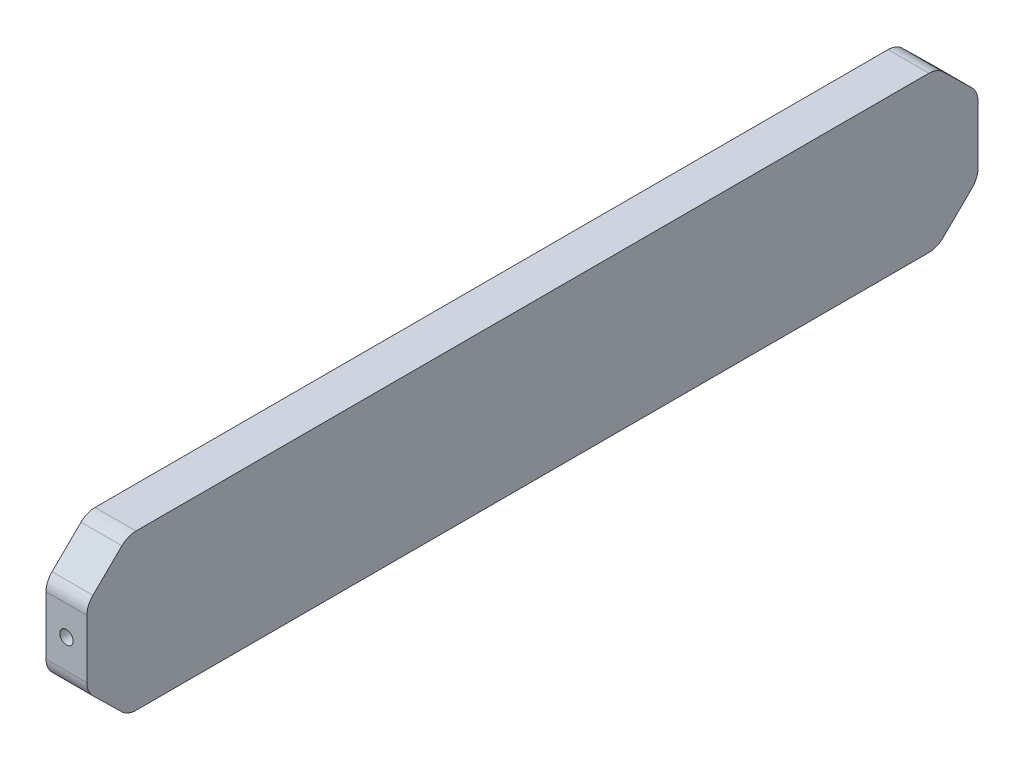
ISO-10303-21;
HEADER;
FILE_DESCRIPTION(('STEP AP214'),'2;1');
FILE_NAME('part.step','',(''),(''),'','','');
FILE_SCHEMA(('AUTOMOTIVE_DESIGN { 1 0 10303 214 1 1 1 1 }'));
ENDSEC;
DATA;
#1=APPLICATION_CONTEXT('core data for automotive mechanical design processes');
#2=APPLICATION_PROTOCOL_DEFINITION('international standard','automotive_design',2000,#1);
#3=PRODUCT_CONTEXT('',#1,'mechanical');
#4=PRODUCT('Part','Part','',(#3));
#5=PRODUCT_RELATED_PRODUCT_CATEGORY('part','',(#4));
#6=PRODUCT_DEFINITION_FORMATION('','',#4);
#7=PRODUCT_DEFINITION_CONTEXT('part definition',#1,'design');
#8=PRODUCT_DEFINITION('design','',#6,#7);
#9=PRODUCT_DEFINITION_SHAPE('','',#8);
#10=(LENGTH_UNIT() NAMED_UNIT(*) SI_UNIT(.MILLI.,.METRE.));
#11=(NAMED_UNIT(*) PLANE_ANGLE_UNIT() SI_UNIT($,.RADIAN.));
#12=(NAMED_UNIT(*) SI_UNIT($,.STERADIAN.) SOLID_ANGLE_UNIT());
#13=UNCERTAINTY_MEASURE_WITH_UNIT(LENGTH_MEASURE(1.E-05),#10,'distance_accuracy_value','');
#14=(GEOMETRIC_REPRESENTATION_CONTEXT(3) GLOBAL_UNCERTAINTY_ASSIGNED_CONTEXT((#13)) GLOBAL_UNIT_ASSIGNED_CONTEXT((#10,
#11,#12)) REPRESENTATION_CONTEXT('',''));
#15=CARTESIAN_POINT('',(0.,0.,0.));
#16=DIRECTION('',(0.,0.,1.));
#17=DIRECTION('',(1.,0.,0.));
#18=AXIS2_PLACEMENT_3D('',#15,#16,#17);
#19=CARTESIAN_POINT('',(0.,38.,0.));
#20=DIRECTION('',(1.,0.,0.));
#21=DIRECTION('',(0.,0.,-1.));
#22=AXIS2_PLACEMENT_3D('',#19,#20,#21);
#23=PLANE('',#22);
#24=DIRECTION('',(0.,0.,1.));
#25=VECTOR('',#24,1.);
#26=CARTESIAN_POINT('',(0.,0.,0.));
#27=LINE('',#26,#25);
#28=CARTESIAN_POINT('',(0.,0.,-205.991418410937));
#29=VERTEX_POINT('',#28);
#30=CARTESIAN_POINT('',(0.,0.,-12.0085815890628));
#31=VERTEX_POINT('',#30);
#32=EDGE_CURVE('E195',#29,#31,#27,.T.);
#33=ORIENTED_EDGE('',*,*,#32,.T.);
#34=CARTESIAN_POINT('',(0.,4.92,-12.0085815890628));
#35=DIRECTION('',(1.,0.,0.));
#36=DIRECTION('',(0.,0.,-1.));
#37=AXIS2_PLACEMENT_3D('',#34,#35,#36);
#38=CIRCLE('',#37,4.92);
#39=CARTESIAN_POINT('',(0.,1.40571428569097,-8.56529886494569));
#40=VERTEX_POINT('',#39);
#41=EDGE_CURVE('E238',#31,#40,#38,.F.);
#42=ORIENTED_EDGE('',*,*,#41,.T.);
#43=DIRECTION('',(0.,0.699854212218928,0.714285714290453));
#44=VECTOR('',#43,1.);
#45=CARTESIAN_POINT('',(0.,0.,-10.));
#46=LINE('',#45,#44);
#47=CARTESIAN_POINT('',(0.,8.35107744291331,-1.47671727588287));
#48=VERTEX_POINT('',#47);
#49=EDGE_CURVE('E184',#40,#48,#46,.T.);
#50=ORIENTED_EDGE('',*,*,#49,.T.);
#51=CARTESIAN_POINT('',(0.,11.8653631572223,-4.92));
#52=DIRECTION('',(1.,0.,0.));
#53=DIRECTION('',(0.,0.,-1.));
#54=AXIS2_PLACEMENT_3D('',#51,#52,#53);
#55=CIRCLE('',#54,4.92);
#56=CARTESIAN_POINT('',(0.,11.8653631572223,0.));
#57=VERTEX_POINT('',#56);
#58=EDGE_CURVE('E236',#48,#57,#55,.F.);
#59=ORIENTED_EDGE('',*,*,#58,.T.);
#60=DIRECTION('',(0.,-1.,0.));
#61=VECTOR('',#60,1.);
#62=CARTESIAN_POINT('',(0.,38.,0.));
#63=LINE('',#62,#61);
#64=CARTESIAN_POINT('',(0.,26.1346368427777,0.));
#65=VERTEX_POINT('',#64);
#66=EDGE_CURVE('E216',#65,#57,#63,.T.);
#67=ORIENTED_EDGE('',*,*,#66,.F.);
#68=CARTESIAN_POINT('',(0.,26.1346368427777,-4.92));
#69=DIRECTION('',(1.,0.,0.));
#70=DIRECTION('',(0.,0.,-1.));
#71=AXIS2_PLACEMENT_3D('',#68,#69,#70);
#72=CIRCLE('',#71,4.92);
#73=CARTESIAN_POINT('',(0.,29.6489225570867,-1.47671727588287));
#74=VERTEX_POINT('',#73);
#75=EDGE_CURVE('E234',#65,#74,#72,.F.);
#76=ORIENTED_EDGE('',*,*,#75,.T.);
#77=DIRECTION('',(0.,0.699854212218928,-0.714285714290453));
#78=VECTOR('',#77,1.);
#79=CARTESIAN_POINT('',(0.,38.,-10.));
#80=LINE('',#79,#78);
#81=CARTESIAN_POINT('',(0.,36.594285714309,-8.56529886494565));
#82=VERTEX_POINT('',#81);
#83=EDGE_CURVE('E173',#74,#82,#80,.T.);
#84=ORIENTED_EDGE('',*,*,#83,.T.);
#85=CARTESIAN_POINT('',(0.,33.08,-12.0085815890628));
#86=DIRECTION('',(1.,0.,0.));
#87=DIRECTION('',(0.,0.,-1.));
#88=AXIS2_PLACEMENT_3D('',#85,#86,#87);
#89=CIRCLE('',#88,4.92);
#90=CARTESIAN_POINT('',(0.,38.,-12.0085815890628));
#91=VERTEX_POINT('',#90);
#92=EDGE_CURVE('E232',#82,#91,#89,.F.);
#93=ORIENTED_EDGE('',*,*,#92,.T.);
#94=DIRECTION('',(0.,0.,1.));
#95=VECTOR('',#94,1.);
#96=CARTESIAN_POINT('',(0.,38.,0.));
#97=LINE('',#96,#95);
#98=CARTESIAN_POINT('',(0.,38.,-205.991418410937));
#99=VERTEX_POINT('',#98);
#100=EDGE_CURVE('E198',#99,#91,#97,.T.);
#101=ORIENTED_EDGE('',*,*,#100,.F.);
#102=CARTESIAN_POINT('',(0.,33.08,-205.991418410937));
#103=DIRECTION('',(1.,0.,0.));
#104=DIRECTION('',(0.,0.,-1.));
#105=AXIS2_PLACEMENT_3D('',#102,#103,#104);
#106=CIRCLE('',#105,4.92);
#107=CARTESIAN_POINT('',(0.,36.594285714309,-209.434701135054));
#108=VERTEX_POINT('',#107);
#109=EDGE_CURVE('E224',#99,#108,#106,.F.);
#110=ORIENTED_EDGE('',*,*,#109,.T.);
#111=DIRECTION('',(0.,-0.699854212218928,-0.714285714290453));
#112=VECTOR('',#111,1.);
#113=CARTESIAN_POINT('',(0.,38.,-208.));
#114=LINE('',#113,#112);
#115=CARTESIAN_POINT('',(0.,29.6489225570867,-216.523282724117));
#116=VERTEX_POINT('',#115);
#117=EDGE_CURVE('E177',#108,#116,#114,.T.);
#118=ORIENTED_EDGE('',*,*,#117,.T.);
#119=CARTESIAN_POINT('',(0.,26.1346368427777,-213.08));
#120=DIRECTION('',(1.,0.,0.));
#121=DIRECTION('',(0.,0.,-1.));
#122=AXIS2_PLACEMENT_3D('',#119,#120,#121);
#123=CIRCLE('',#122,4.92);
#124=CARTESIAN_POINT('',(0.,26.1346368427777,-218.));
#125=VERTEX_POINT('',#124);
#126=EDGE_CURVE('E226',#116,#125,#123,.F.);
#127=ORIENTED_EDGE('',*,*,#126,.T.);
#128=DIRECTION('',(0.,-1.,0.));
#129=VECTOR('',#128,1.);
#130=CARTESIAN_POINT('',(0.,38.,-218.));
#131=LINE('',#130,#129);
#132=CARTESIAN_POINT('',(0.,11.8653631572223,-218.));
#133=VERTEX_POINT('',#132);
#134=EDGE_CURVE('E203',#125,#133,#131,.T.);
#135=ORIENTED_EDGE('',*,*,#134,.T.);
#136=CARTESIAN_POINT('',(0.,11.8653631572223,-213.08));
#137=DIRECTION('',(1.,0.,0.));
#138=DIRECTION('',(0.,0.,-1.));
#139=AXIS2_PLACEMENT_3D('',#136,#137,#138);
#140=CIRCLE('',#139,4.92);
#141=CARTESIAN_POINT('',(0.,8.35107744291325,-216.523282724117));
#142=VERTEX_POINT('',#141);
#143=EDGE_CURVE('E228',#133,#142,#140,.F.);
#144=ORIENTED_EDGE('',*,*,#143,.T.);
#145=DIRECTION('',(0.,-0.699854212218928,0.714285714290453));
#146=VECTOR('',#145,1.);
#147=CARTESIAN_POINT('',(0.,0.,-208.));
#148=LINE('',#147,#146);
#149=CARTESIAN_POINT('',(0.,1.40571428569097,-209.434701135054));
#150=VERTEX_POINT('',#149);
#151=EDGE_CURVE('E178',#142,#150,#148,.T.);
#152=ORIENTED_EDGE('',*,*,#151,.T.);
#153=CARTESIAN_POINT('',(0.,4.92,-205.991418410937));
#154=DIRECTION('',(1.,0.,0.));
#155=DIRECTION('',(0.,0.,-1.));
#156=AXIS2_PLACEMENT_3D('',#153,#154,#155);
#157=CIRCLE('',#156,4.92);
#158=EDGE_CURVE('E230',#150,#29,#157,.F.);
#159=ORIENTED_EDGE('',*,*,#158,.T.);
#160=EDGE_LOOP('',(#33,#42,#50,#59,#67,#76,#84,#93,#101,#110,#118,#127,#135,#144,#152,#159));
#161=FACE_BOUND('',#160,.T.);
#162=ADVANCED_FACE('F33',(#161),#23,.F.);
#163=CARTESIAN_POINT('',(0.,38.,0.));
#164=DIRECTION('',(0.,0.,-1.));
#165=DIRECTION('',(-1.,0.,0.));
#166=AXIS2_PLACEMENT_3D('',#163,#164,#165);
#167=PLANE('',#166);
#168=CARTESIAN_POINT('',(5.,19.,0.));
#169=DIRECTION('',(0.,0.,1.));
#170=DIRECTION('',(1.,0.,0.));
#171=AXIS2_PLACEMENT_3D('',#168,#169,#170);
#172=CIRCLE('',#171,1.63195);
#173=CARTESIAN_POINT('',(6.63195,19.,0.));
#174=VERTEX_POINT('',#173);
#175=EDGE_CURVE('E162',#174,#174,#172,.T.);
#176=ORIENTED_EDGE('',*,*,#175,.F.);
#177=EDGE_LOOP('',(#176));
#178=FACE_BOUND('',#177,.T.);
#179=ORIENTED_EDGE('',*,*,#66,.T.);
#180=DIRECTION('',(-1.,0.,0.));
#181=VECTOR('',#180,1.);
#182=CARTESIAN_POINT('',(10.,11.8653631572223,0.));
#183=LINE('',#182,#181);
#184=CARTESIAN_POINT('',(10.,11.8653631572223,0.));
#185=VERTEX_POINT('',#184);
#186=EDGE_CURVE('E263',#57,#185,#183,.F.);
#187=ORIENTED_EDGE('',*,*,#186,.T.);
#188=DIRECTION('',(0.,-1.,0.));
#189=VECTOR('',#188,1.);
#190=CARTESIAN_POINT('',(10.,38.,0.));
#191=LINE('',#190,#189);
#192=CARTESIAN_POINT('',(10.,26.1346368427777,0.));
#193=VERTEX_POINT('',#192);
#194=EDGE_CURVE('E213',#193,#185,#191,.T.);
#195=ORIENTED_EDGE('',*,*,#194,.F.);
#196=DIRECTION('',(-1.,0.,0.));
#197=VECTOR('',#196,1.);
#198=CARTESIAN_POINT('',(0.,26.1346368427777,0.));
#199=LINE('',#198,#197);
#200=EDGE_CURVE('E260',#193,#65,#199,.T.);
#201=ORIENTED_EDGE('',*,*,#200,.T.);
#202=EDGE_LOOP('',(#179,#187,#195,#201));
#203=FACE_BOUND('',#202,.T.);
#204=ADVANCED_FACE('F313',(#178,#203),#167,.F.);
#205=CARTESIAN_POINT('',(10.,38.,0.));
#206=DIRECTION('',(-1.,0.,0.));
#207=DIRECTION('',(0.,0.,1.));
#208=AXIS2_PLACEMENT_3D('',#205,#206,#207);
#209=PLANE('',#208);
#210=DIRECTION('',(0.,0.699854212218928,0.714285714290453));
#211=VECTOR('',#210,1.);
#212=CARTESIAN_POINT('',(10.,0.,-10.));
#213=LINE('',#212,#211);
#214=CARTESIAN_POINT('',(10.,1.40571428569097,-8.56529886494569));
#215=VERTEX_POINT('',#214);
#216=CARTESIAN_POINT('',(10.,8.35107744291331,-1.47671727588287));
#217=VERTEX_POINT('',#216);
#218=EDGE_CURVE('E181',#215,#217,#213,.T.);
#219=ORIENTED_EDGE('',*,*,#218,.F.);
#220=CARTESIAN_POINT('',(10.,4.92,-12.0085815890628));
#221=DIRECTION('',(-1.,0.,0.));
#222=DIRECTION('',(0.,0.,1.));
#223=AXIS2_PLACEMENT_3D('',#220,#221,#222);
#224=CIRCLE('',#223,4.92);
#225=CARTESIAN_POINT('',(10.,0.,-12.0085815890628));
#226=VERTEX_POINT('',#225);
#227=EDGE_CURVE('E258',#215,#226,#224,.F.);
#228=ORIENTED_EDGE('',*,*,#227,.T.);
#229=DIRECTION('',(0.,0.,-1.));
#230=VECTOR('',#229,1.);
#231=CARTESIAN_POINT('',(10.,0.,0.));
#232=LINE('',#231,#230);
#233=CARTESIAN_POINT('',(10.,0.,-205.991418410937));
#234=VERTEX_POINT('',#233);
#235=EDGE_CURVE('E201',#226,#234,#232,.T.);
#236=ORIENTED_EDGE('',*,*,#235,.T.);
#237=CARTESIAN_POINT('',(10.,4.92,-205.991418410937));
#238=DIRECTION('',(-1.,0.,0.));
#239=DIRECTION('',(0.,0.,1.));
#240=AXIS2_PLACEMENT_3D('',#237,#238,#239);
#241=CIRCLE('',#240,4.92);
#242=CARTESIAN_POINT('',(10.,1.40571428569097,-209.434701135054));
#243=VERTEX_POINT('',#242);
#244=EDGE_CURVE('E250',#234,#243,#241,.F.);
#245=ORIENTED_EDGE('',*,*,#244,.T.);
#246=DIRECTION('',(0.,-0.699854212218928,0.714285714290453));
#247=VECTOR('',#246,1.);
#248=CARTESIAN_POINT('',(10.,0.,-208.));
#249=LINE('',#248,#247);
#250=CARTESIAN_POINT('',(10.,8.35107744291325,-216.523282724117));
#251=VERTEX_POINT('',#250);
#252=EDGE_CURVE('E174',#251,#243,#249,.T.);
#253=ORIENTED_EDGE('',*,*,#252,.F.);
#254=CARTESIAN_POINT('',(10.,11.8653631572223,-213.08));
#255=DIRECTION('',(-1.,0.,0.));
#256=DIRECTION('',(0.,0.,1.));
#257=AXIS2_PLACEMENT_3D('',#254,#255,#256);
#258=CIRCLE('',#257,4.92);
#259=CARTESIAN_POINT('',(10.,11.8653631572223,-218.));
#260=VERTEX_POINT('',#259);
#261=EDGE_CURVE('E248',#251,#260,#258,.F.);
#262=ORIENTED_EDGE('',*,*,#261,.T.);
#263=DIRECTION('',(0.,-1.,0.));
#264=VECTOR('',#263,1.);
#265=CARTESIAN_POINT('',(10.,38.,-218.));
#266=LINE('',#265,#264);
#267=CARTESIAN_POINT('',(10.,26.1346368427777,-218.));
#268=VERTEX_POINT('',#267);
#269=EDGE_CURVE('E210',#268,#260,#266,.T.);
#270=ORIENTED_EDGE('',*,*,#269,.F.);
#271=CARTESIAN_POINT('',(10.,26.1346368427777,-213.08));
#272=DIRECTION('',(-1.,0.,0.));
#273=DIRECTION('',(0.,0.,1.));
#274=AXIS2_PLACEMENT_3D('',#271,#272,#273);
#275=CIRCLE('',#274,4.92);
#276=CARTESIAN_POINT('',(10.,29.6489225570867,-216.523282724117));
#277=VERTEX_POINT('',#276);
#278=EDGE_CURVE('E246',#268,#277,#275,.F.);
#279=ORIENTED_EDGE('',*,*,#278,.T.);
#280=DIRECTION('',(0.,-0.699854212218928,-0.714285714290453));
#281=VECTOR('',#280,1.);
#282=CARTESIAN_POINT('',(10.,38.,-208.));
#283=LINE('',#282,#281);
#284=CARTESIAN_POINT('',(10.,36.594285714309,-209.434701135054));
#285=VERTEX_POINT('',#284);
#286=EDGE_CURVE('E192',#285,#277,#283,.T.);
#287=ORIENTED_EDGE('',*,*,#286,.F.);
#288=CARTESIAN_POINT('',(10.,33.08,-205.991418410937));
#289=DIRECTION('',(-1.,0.,0.));
#290=DIRECTION('',(0.,0.,1.));
#291=AXIS2_PLACEMENT_3D('',#288,#289,#290);
#292=CIRCLE('',#291,4.92);
#293=CARTESIAN_POINT('',(10.,38.,-205.991418410937));
#294=VERTEX_POINT('',#293);
#295=EDGE_CURVE('E48',#285,#294,#292,.F.);
#296=ORIENTED_EDGE('',*,*,#295,.T.);
#297=DIRECTION('',(0.,0.,-1.));
#298=VECTOR('',#297,1.);
#299=CARTESIAN_POINT('',(10.,38.,0.));
#300=LINE('',#299,#298);
#301=CARTESIAN_POINT('',(10.,38.,-12.0085815890628));
#302=VERTEX_POINT('',#301);
#303=EDGE_CURVE('E200',#302,#294,#300,.T.);
#304=ORIENTED_EDGE('',*,*,#303,.F.);
#305=CARTESIAN_POINT('',(10.,33.08,-12.0085815890628));
#306=DIRECTION('',(-1.,0.,0.));
#307=DIRECTION('',(0.,0.,1.));
#308=AXIS2_PLACEMENT_3D('',#305,#306,#307);
#309=CIRCLE('',#308,4.92);
#310=CARTESIAN_POINT('',(10.,36.594285714309,-8.56529886494565));
#311=VERTEX_POINT('',#310);
#312=EDGE_CURVE('E252',#302,#311,#309,.F.);
#313=ORIENTED_EDGE('',*,*,#312,.T.);
#314=DIRECTION('',(0.,0.699854212218928,-0.714285714290453));
#315=VECTOR('',#314,1.);
#316=CARTESIAN_POINT('',(10.,38.,-10.));
#317=LINE('',#316,#315);
#318=CARTESIAN_POINT('',(10.,29.6489225570867,-1.47671727588287));
#319=VERTEX_POINT('',#318);
#320=EDGE_CURVE('E187',#319,#311,#317,.T.);
#321=ORIENTED_EDGE('',*,*,#320,.F.);
#322=CARTESIAN_POINT('',(10.,26.1346368427777,-4.92));
#323=DIRECTION('',(-1.,0.,0.));
#324=DIRECTION('',(0.,0.,1.));
#325=AXIS2_PLACEMENT_3D('',#322,#323,#324);
#326=CIRCLE('',#325,4.92);
#327=EDGE_CURVE('E254',#319,#193,#326,.F.);
#328=ORIENTED_EDGE('',*,*,#327,.T.);
#329=ORIENTED_EDGE('',*,*,#194,.T.);
#330=CARTESIAN_POINT('',(10.,11.8653631572223,-4.92));
#331=DIRECTION('',(-1.,0.,0.));
#332=DIRECTION('',(0.,0.,1.));
#333=AXIS2_PLACEMENT_3D('',#330,#331,#332);
#334=CIRCLE('',#333,4.92);
#335=EDGE_CURVE('E256',#185,#217,#334,.F.);
#336=ORIENTED_EDGE('',*,*,#335,.T.);
#337=EDGE_LOOP('',(#219,#228,#236,#245,#253,#262,#270,#279,#287,#296,#304,#313,#321,#328,#329,#336));
#338=FACE_BOUND('',#337,.T.);
#339=ADVANCED_FACE('F290',(#338),#209,.F.);
#340=CARTESIAN_POINT('',(0.,38.,-218.));
#341=DIRECTION('',(0.,0.,1.));
#342=DIRECTION('',(1.,0.,0.));
#343=AXIS2_PLACEMENT_3D('',#340,#341,#342);
#344=PLANE('',#343);
#345=CARTESIAN_POINT('',(5.,19.,-218.));
#346=DIRECTION('',(0.,0.,-1.));
#347=DIRECTION('',(-1.,0.,0.));
#348=AXIS2_PLACEMENT_3D('',#345,#346,#347);
#349=CIRCLE('',#348,1.63194999999999);
#350=CARTESIAN_POINT('',(3.36805000000001,19.,-218.));
#351=VERTEX_POINT('',#350);
#352=EDGE_CURVE('E163',#351,#351,#349,.T.);
#353=ORIENTED_EDGE('',*,*,#352,.F.);
#354=EDGE_LOOP('',(#353));
#355=FACE_BOUND('',#354,.T.);
#356=ORIENTED_EDGE('',*,*,#269,.T.);
#357=DIRECTION('',(-1.,0.,0.));
#358=VECTOR('',#357,1.);
#359=CARTESIAN_POINT('',(0.,11.8653631572223,-218.));
#360=LINE('',#359,#358);
#361=EDGE_CURVE('E281',#260,#133,#360,.T.);
#362=ORIENTED_EDGE('',*,*,#361,.T.);
#363=ORIENTED_EDGE('',*,*,#134,.F.);
#364=DIRECTION('',(-1.,0.,0.));
#365=VECTOR('',#364,1.);
#366=CARTESIAN_POINT('',(10.,26.1346368427777,-218.));
#367=LINE('',#366,#365);
#368=EDGE_CURVE('E279',#125,#268,#367,.F.);
#369=ORIENTED_EDGE('',*,*,#368,.T.);
#370=EDGE_LOOP('',(#356,#362,#363,#369));
#371=FACE_BOUND('',#370,.T.);
#372=ADVANCED_FACE('F347',(#355,#371),#344,.F.);
#373=CARTESIAN_POINT('',(0.,38.,0.));
#374=DIRECTION('',(0.,-1.,0.));
#375=DIRECTION('',(0.,0.,-1.));
#376=AXIS2_PLACEMENT_3D('',#373,#374,#375);
#377=PLANE('',#376);
#378=ORIENTED_EDGE('',*,*,#100,.T.);
#379=DIRECTION('',(-1.,0.,0.));
#380=VECTOR('',#379,1.);
#381=CARTESIAN_POINT('',(10.,38.,-12.0085815890628));
#382=LINE('',#381,#380);
#383=EDGE_CURVE('E55',#91,#302,#382,.F.);
#384=ORIENTED_EDGE('',*,*,#383,.T.);
#385=ORIENTED_EDGE('',*,*,#303,.T.);
#386=DIRECTION('',(-1.,0.,0.));
#387=VECTOR('',#386,1.);
#388=CARTESIAN_POINT('',(0.,38.,-205.991418410937));
#389=LINE('',#388,#387);
#390=EDGE_CURVE('E270',#294,#99,#389,.T.);
#391=ORIENTED_EDGE('',*,*,#390,.T.);
#392=EDGE_LOOP('',(#378,#384,#385,#391));
#393=FACE_BOUND('',#392,.T.);
#394=ADVANCED_FACE('F295',(#393),#377,.F.);
#395=CARTESIAN_POINT('',(0.,0.,0.));
#396=DIRECTION('',(0.,-1.,0.));
#397=DIRECTION('',(0.,0.,-1.));
#398=AXIS2_PLACEMENT_3D('',#395,#396,#397);
#399=PLANE('',#398);
#400=ORIENTED_EDGE('',*,*,#235,.F.);
#401=DIRECTION('',(-1.,0.,0.));
#402=VECTOR('',#401,1.);
#403=CARTESIAN_POINT('',(0.,0.,-12.0085815890628));
#404=LINE('',#403,#402);
#405=EDGE_CURVE('E221',#226,#31,#404,.T.);
#406=ORIENTED_EDGE('',*,*,#405,.T.);
#407=ORIENTED_EDGE('',*,*,#32,.F.);
#408=DIRECTION('',(-1.,0.,0.));
#409=VECTOR('',#408,1.);
#410=CARTESIAN_POINT('',(0.,0.,-205.991418410937));
#411=LINE('',#410,#409);
#412=EDGE_CURVE('E219',#29,#234,#411,.F.);
#413=ORIENTED_EDGE('',*,*,#412,.T.);
#414=EDGE_LOOP('',(#400,#406,#407,#413));
#415=FACE_BOUND('',#414,.T.);
#416=ADVANCED_FACE('F330',(#415),#399,.T.);
#417=CARTESIAN_POINT('',(10.,0.,-208.));
#418=DIRECTION('',(0.,-0.714285714290453,-0.699854212218928));
#419=DIRECTION('',(0.,0.699854212218928,-0.714285714290453));
#420=AXIS2_PLACEMENT_3D('',#417,#418,#419);
#421=PLANE('',#420);
#422=ORIENTED_EDGE('',*,*,#252,.T.);
#423=DIRECTION('',(-1.,0.,0.));
#424=VECTOR('',#423,1.);
#425=CARTESIAN_POINT('',(10.,1.40571428569097,-209.434701135054));
#426=LINE('',#425,#424);
#427=EDGE_CURVE('E276',#243,#150,#426,.T.);
#428=ORIENTED_EDGE('',*,*,#427,.T.);
#429=ORIENTED_EDGE('',*,*,#151,.F.);
#430=DIRECTION('',(-1.,0.,0.));
#431=VECTOR('',#430,1.);
#432=CARTESIAN_POINT('',(10.,8.35107744291325,-216.523282724117));
#433=LINE('',#432,#431);
#434=EDGE_CURVE('E274',#142,#251,#433,.F.);
#435=ORIENTED_EDGE('',*,*,#434,.T.);
#436=EDGE_LOOP('',(#422,#428,#429,#435));
#437=FACE_BOUND('',#436,.T.);
#438=ADVANCED_FACE('F338',(#437),#421,.T.);
#439=CARTESIAN_POINT('',(10.,0.,-10.));
#440=DIRECTION('',(0.,-0.714285714290453,0.699854212218928));
#441=DIRECTION('',(0.,-0.699854212218928,-0.714285714290453));
#442=AXIS2_PLACEMENT_3D('',#439,#440,#441);
#443=PLANE('',#442);
#444=ORIENTED_EDGE('',*,*,#49,.F.);
#445=DIRECTION('',(-1.,0.,0.));
#446=VECTOR('',#445,1.);
#447=CARTESIAN_POINT('',(10.,1.40571428569097,-8.5652988649457));
#448=LINE('',#447,#446);
#449=EDGE_CURVE('E243',#40,#215,#448,.F.);
#450=ORIENTED_EDGE('',*,*,#449,.T.);
#451=ORIENTED_EDGE('',*,*,#218,.T.);
#452=DIRECTION('',(-1.,0.,0.));
#453=VECTOR('',#452,1.);
#454=CARTESIAN_POINT('',(0.,8.35107744291331,-1.47671727588287));
#455=LINE('',#454,#453);
#456=EDGE_CURVE('E240',#217,#48,#455,.T.);
#457=ORIENTED_EDGE('',*,*,#456,.T.);
#458=EDGE_LOOP('',(#444,#450,#451,#457));
#459=FACE_BOUND('',#458,.T.);
#460=ADVANCED_FACE('F321',(#459),#443,.T.);
#461=CARTESIAN_POINT('',(10.,38.,-208.));
#462=DIRECTION('',(0.,0.714285714290453,-0.699854212218928));
#463=DIRECTION('',(0.,0.699854212218928,0.714285714290453));
#464=AXIS2_PLACEMENT_3D('',#461,#462,#463);
#465=PLANE('',#464);
#466=ORIENTED_EDGE('',*,*,#286,.T.);
#467=DIRECTION('',(-1.,0.,0.));
#468=VECTOR('',#467,1.);
#469=CARTESIAN_POINT('',(0.,29.6489225570867,-216.523282724117));
#470=LINE('',#469,#468);
#471=EDGE_CURVE('E11',#277,#116,#470,.T.);
#472=ORIENTED_EDGE('',*,*,#471,.T.);
#473=ORIENTED_EDGE('',*,*,#117,.F.);
#474=DIRECTION('',(-1.,0.,0.));
#475=VECTOR('',#474,1.);
#476=CARTESIAN_POINT('',(10.,36.594285714309,-209.434701135054));
#477=LINE('',#476,#475);
#478=EDGE_CURVE('E41',#108,#285,#477,.F.);
#479=ORIENTED_EDGE('',*,*,#478,.T.);
#480=EDGE_LOOP('',(#466,#472,#473,#479));
#481=FACE_BOUND('',#480,.T.);
#482=ADVANCED_FACE('F286',(#481),#465,.T.);
#483=CARTESIAN_POINT('',(10.,38.,-10.));
#484=DIRECTION('',(0.,0.714285714290453,0.699854212218928));
#485=DIRECTION('',(0.,-0.699854212218928,0.714285714290453));
#486=AXIS2_PLACEMENT_3D('',#483,#484,#485);
#487=PLANE('',#486);
#488=ORIENTED_EDGE('',*,*,#83,.F.);
#489=DIRECTION('',(-1.,0.,0.));
#490=VECTOR('',#489,1.);
#491=CARTESIAN_POINT('',(10.,29.6489225570867,-1.47671727588287));
#492=LINE('',#491,#490);
#493=EDGE_CURVE('E268',#74,#319,#492,.F.);
#494=ORIENTED_EDGE('',*,*,#493,.T.);
#495=ORIENTED_EDGE('',*,*,#320,.T.);
#496=DIRECTION('',(-1.,0.,0.));
#497=VECTOR('',#496,1.);
#498=CARTESIAN_POINT('',(0.,36.594285714309,-8.56529886494565));
#499=LINE('',#498,#497);
#500=EDGE_CURVE('E265',#311,#82,#499,.T.);
#501=ORIENTED_EDGE('',*,*,#500,.T.);
#502=EDGE_LOOP('',(#488,#494,#495,#501));
#503=FACE_BOUND('',#502,.T.);
#504=ADVANCED_FACE('F303',(#503),#487,.T.);
#505=CARTESIAN_POINT('',(0.,4.92,-12.0085815890628));
#506=DIRECTION('',(-1.,0.,0.));
#507=DIRECTION('',(0.,0.,1.));
#508=AXIS2_PLACEMENT_3D('',#505,#506,#507);
#509=CYLINDRICAL_SURFACE('',#508,4.92);
#510=ORIENTED_EDGE('',*,*,#227,.F.);
#511=ORIENTED_EDGE('',*,*,#449,.F.);
#512=ORIENTED_EDGE('',*,*,#41,.F.);
#513=ORIENTED_EDGE('',*,*,#405,.F.);
#514=EDGE_LOOP('',(#510,#511,#512,#513));
#515=FACE_BOUND('',#514,.T.);
#516=ADVANCED_FACE('F327',(#515),#509,.T.);
#517=CARTESIAN_POINT('',(10.,11.8653631572223,-4.92));
#518=DIRECTION('',(1.,0.,0.));
#519=DIRECTION('',(0.,0.,-1.));
#520=AXIS2_PLACEMENT_3D('',#517,#518,#519);
#521=CYLINDRICAL_SURFACE('',#520,4.92);
#522=ORIENTED_EDGE('',*,*,#335,.F.);
#523=ORIENTED_EDGE('',*,*,#186,.F.);
#524=ORIENTED_EDGE('',*,*,#58,.F.);
#525=ORIENTED_EDGE('',*,*,#456,.F.);
#526=EDGE_LOOP('',(#522,#523,#524,#525));
#527=FACE_BOUND('',#526,.T.);
#528=ADVANCED_FACE('F319',(#527),#521,.T.);
#529=CARTESIAN_POINT('',(0.,26.1346368427777,-4.92));
#530=DIRECTION('',(1.,0.,0.));
#531=DIRECTION('',(0.,0.,-1.));
#532=AXIS2_PLACEMENT_3D('',#529,#530,#531);
#533=CYLINDRICAL_SURFACE('',#532,4.92);
#534=ORIENTED_EDGE('',*,*,#327,.F.);
#535=ORIENTED_EDGE('',*,*,#493,.F.);
#536=ORIENTED_EDGE('',*,*,#75,.F.);
#537=ORIENTED_EDGE('',*,*,#200,.F.);
#538=EDGE_LOOP('',(#534,#535,#536,#537));
#539=FACE_BOUND('',#538,.T.);
#540=ADVANCED_FACE('F310',(#539),#533,.T.);
#541=CARTESIAN_POINT('',(10.,33.08,-12.0085815890628));
#542=DIRECTION('',(1.,0.,0.));
#543=DIRECTION('',(0.,0.,-1.));
#544=AXIS2_PLACEMENT_3D('',#541,#542,#543);
#545=CYLINDRICAL_SURFACE('',#544,4.92);
#546=ORIENTED_EDGE('',*,*,#312,.F.);
#547=ORIENTED_EDGE('',*,*,#383,.F.);
#548=ORIENTED_EDGE('',*,*,#92,.F.);
#549=ORIENTED_EDGE('',*,*,#500,.F.);
#550=EDGE_LOOP('',(#546,#547,#548,#549));
#551=FACE_BOUND('',#550,.T.);
#552=ADVANCED_FACE('F301',(#551),#545,.T.);
#553=CARTESIAN_POINT('',(10.,4.92,-205.991418410937));
#554=DIRECTION('',(-1.,0.,0.));
#555=DIRECTION('',(0.,0.,1.));
#556=AXIS2_PLACEMENT_3D('',#553,#554,#555);
#557=CYLINDRICAL_SURFACE('',#556,4.92);
#558=ORIENTED_EDGE('',*,*,#244,.F.);
#559=ORIENTED_EDGE('',*,*,#412,.F.);
#560=ORIENTED_EDGE('',*,*,#158,.F.);
#561=ORIENTED_EDGE('',*,*,#427,.F.);
#562=EDGE_LOOP('',(#558,#559,#560,#561));
#563=FACE_BOUND('',#562,.T.);
#564=ADVANCED_FACE('F336',(#563),#557,.T.);
#565=CARTESIAN_POINT('',(0.,11.8653631572223,-213.08));
#566=DIRECTION('',(1.,0.,0.));
#567=DIRECTION('',(0.,0.,-1.));
#568=AXIS2_PLACEMENT_3D('',#565,#566,#567);
#569=CYLINDRICAL_SURFACE('',#568,4.92);
#570=ORIENTED_EDGE('',*,*,#261,.F.);
#571=ORIENTED_EDGE('',*,*,#434,.F.);
#572=ORIENTED_EDGE('',*,*,#143,.F.);
#573=ORIENTED_EDGE('',*,*,#361,.F.);
#574=EDGE_LOOP('',(#570,#571,#572,#573));
#575=FACE_BOUND('',#574,.T.);
#576=ADVANCED_FACE('F344',(#575),#569,.T.);
#577=CARTESIAN_POINT('',(10.,26.1346368427777,-213.08));
#578=DIRECTION('',(1.,0.,0.));
#579=DIRECTION('',(0.,0.,-1.));
#580=AXIS2_PLACEMENT_3D('',#577,#578,#579);
#581=CYLINDRICAL_SURFACE('',#580,4.92);
#582=ORIENTED_EDGE('',*,*,#278,.F.);
#583=ORIENTED_EDGE('',*,*,#368,.F.);
#584=ORIENTED_EDGE('',*,*,#126,.F.);
#585=ORIENTED_EDGE('',*,*,#471,.F.);
#586=EDGE_LOOP('',(#582,#583,#584,#585));
#587=FACE_BOUND('',#586,.T.);
#588=ADVANCED_FACE('F350',(#587),#581,.T.);
#589=CARTESIAN_POINT('',(0.,33.08,-205.991418410937));
#590=DIRECTION('',(1.,0.,0.));
#591=DIRECTION('',(0.,0.,-1.));
#592=AXIS2_PLACEMENT_3D('',#589,#590,#591);
#593=CYLINDRICAL_SURFACE('',#592,4.92);
#594=ORIENTED_EDGE('',*,*,#295,.F.);
#595=ORIENTED_EDGE('',*,*,#478,.F.);
#596=ORIENTED_EDGE('',*,*,#109,.F.);
#597=ORIENTED_EDGE('',*,*,#390,.F.);
#598=EDGE_LOOP('',(#594,#595,#596,#597));
#599=FACE_BOUND('',#598,.T.);
#600=ADVANCED_FACE('F35',(#599),#593,.T.);
#601=CARTESIAN_POINT('',(5.,19.,-9.99998));
#602=DIRECTION('',(0.,0.,1.));
#603=DIRECTION('',(1.,0.,0.));
#604=AXIS2_PLACEMENT_3D('',#601,#602,#603);
#605=CONICAL_SURFACE('',#604,1.63195,1.02974425867665);
#606=CARTESIAN_POINT('',(5.,19.,-10.980554487222));
#607=VERTEX_POINT('',#606);
#608=VERTEX_LOOP('',#607);
#609=FACE_BOUND('',#608,.T.);
#610=CARTESIAN_POINT('',(5.,19.,-9.99998));
#611=DIRECTION('',(0.,0.,1.));
#612=DIRECTION('',(1.,0.,0.));
#613=AXIS2_PLACEMENT_3D('',#610,#611,#612);
#614=CIRCLE('',#613,1.63195);
#615=CARTESIAN_POINT('',(6.63195,19.,-9.99998));
#616=VERTEX_POINT('',#615);
#617=EDGE_CURVE('E166',#616,#616,#614,.T.);
#618=ORIENTED_EDGE('',*,*,#617,.T.);
#619=EDGE_LOOP('',(#618));
#620=FACE_BOUND('',#619,.T.);
#621=ADVANCED_FACE('F356',(#609,#620),#605,.F.);
#622=CARTESIAN_POINT('',(5.,19.,0.));
#623=DIRECTION('',(0.,0.,1.));
#624=DIRECTION('',(1.,0.,0.));
#625=AXIS2_PLACEMENT_3D('',#622,#623,#624);
#626=CYLINDRICAL_SURFACE('',#625,1.63195);
#627=ORIENTED_EDGE('',*,*,#617,.F.);
#628=EDGE_LOOP('',(#627));
#629=FACE_BOUND('',#628,.T.);
#630=ORIENTED_EDGE('',*,*,#175,.T.);
#631=EDGE_LOOP('',(#630));
#632=FACE_BOUND('',#631,.T.);
#633=ADVANCED_FACE('F156',(#629,#632),#626,.F.);
#634=CARTESIAN_POINT('',(5.,19.,-208.094));
#635=DIRECTION('',(0.,0.,-1.));
#636=DIRECTION('',(-1.,0.,0.));
#637=AXIS2_PLACEMENT_3D('',#634,#635,#636);
#638=CONICAL_SURFACE('',#637,1.63195,1.02974425867665);
#639=CARTESIAN_POINT('',(5.,19.,-207.113425512778));
#640=VERTEX_POINT('',#639);
#641=VERTEX_LOOP('',#640);
#642=FACE_BOUND('',#641,.T.);
#643=CARTESIAN_POINT('',(5.,19.,-208.094));
#644=DIRECTION('',(0.,0.,-1.));
#645=DIRECTION('',(-1.,0.,0.));
#646=AXIS2_PLACEMENT_3D('',#643,#644,#645);
#647=CIRCLE('',#646,1.63195);
#648=CARTESIAN_POINT('',(3.36805,19.,-208.094));
#649=VERTEX_POINT('',#648);
#650=EDGE_CURVE('E160',#649,#649,#647,.T.);
#651=ORIENTED_EDGE('',*,*,#650,.T.);
#652=EDGE_LOOP('',(#651));
#653=FACE_BOUND('',#652,.T.);
#654=ADVANCED_FACE('F152',(#642,#653),#638,.F.);
#655=CARTESIAN_POINT('',(5.,19.,-218.));
#656=DIRECTION('',(0.,0.,-1.));
#657=DIRECTION('',(-1.,0.,0.));
#658=AXIS2_PLACEMENT_3D('',#655,#656,#657);
#659=CYLINDRICAL_SURFACE('',#658,1.63194999999999);
#660=ORIENTED_EDGE('',*,*,#650,.F.);
#661=EDGE_LOOP('',(#660));
#662=FACE_BOUND('',#661,.T.);
#663=ORIENTED_EDGE('',*,*,#352,.T.);
#664=EDGE_LOOP('',(#663));
#665=FACE_BOUND('',#664,.T.);
#666=ADVANCED_FACE('F155',(#662,#665),#659,.F.);
#667=CLOSED_SHELL('',(#162,#204,#339,#372,#394,#416,#438,#460,#482,#504,#516,#528,#540,#552,
#564,#576,#588,#600,#621,#633,#654,#666));
#668=MANIFOLD_SOLID_BREP('B2',#667);
#669=ADVANCED_BREP_SHAPE_REPRESENTATION('',(#18,#668),#14);
#670=SHAPE_DEFINITION_REPRESENTATION(#9,#669);
ENDSEC;
END-ISO-10303-21;
